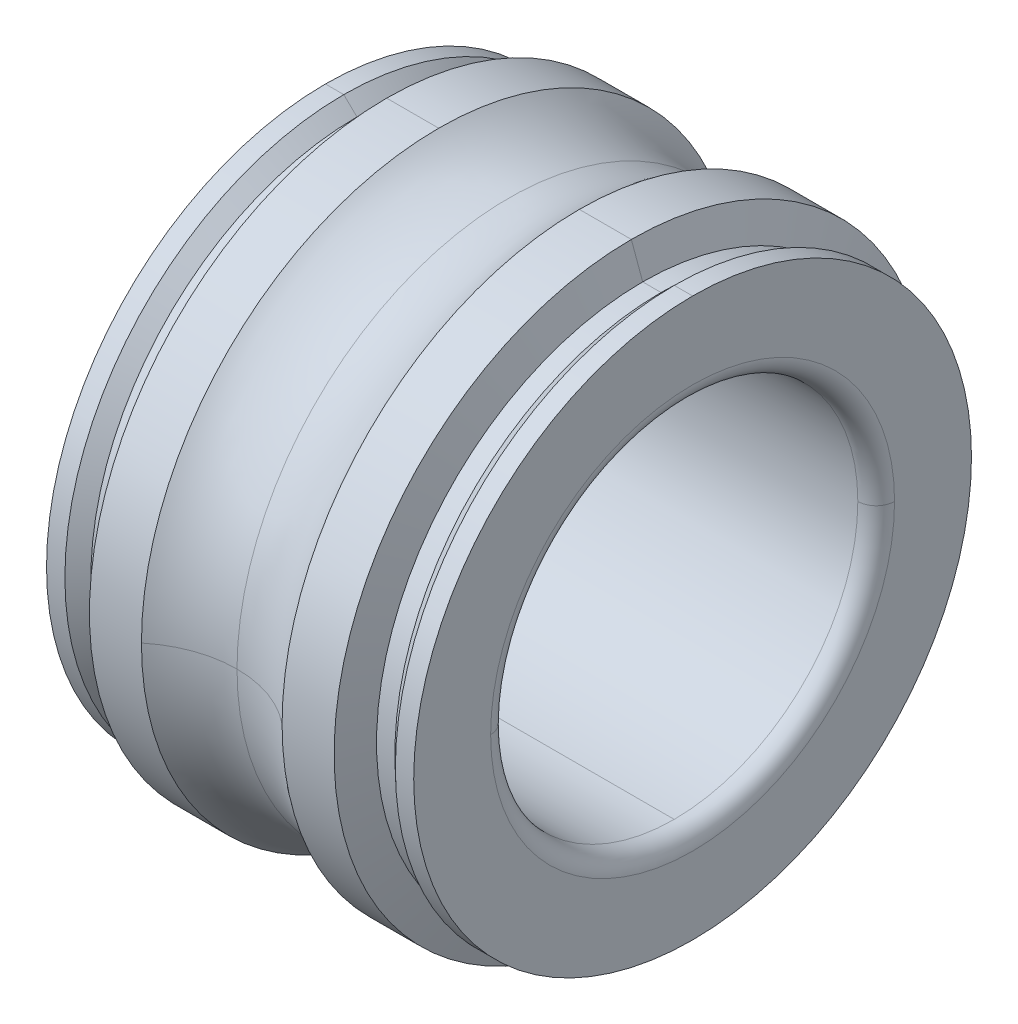
ISO-10303-21;
HEADER;
FILE_DESCRIPTION(('STEP AP214'),'2;1');
FILE_NAME('part.step','',(''),(''),'','','');
FILE_SCHEMA(('AUTOMOTIVE_DESIGN { 1 0 10303 214 1 1 1 1 }'));
ENDSEC;
DATA;
#1=APPLICATION_CONTEXT('core data for automotive mechanical design processes');
#2=APPLICATION_PROTOCOL_DEFINITION('international standard','automotive_design',2000,#1);
#3=PRODUCT_CONTEXT('',#1,'mechanical');
#4=PRODUCT('Part','Part','',(#3));
#5=PRODUCT_RELATED_PRODUCT_CATEGORY('part','',(#4));
#6=PRODUCT_DEFINITION_FORMATION('','',#4);
#7=PRODUCT_DEFINITION_CONTEXT('part definition',#1,'design');
#8=PRODUCT_DEFINITION('design','',#6,#7);
#9=PRODUCT_DEFINITION_SHAPE('','',#8);
#10=(LENGTH_UNIT() NAMED_UNIT(*) SI_UNIT(.MILLI.,.METRE.));
#11=(NAMED_UNIT(*) PLANE_ANGLE_UNIT() SI_UNIT($,.RADIAN.));
#12=(NAMED_UNIT(*) SI_UNIT($,.STERADIAN.) SOLID_ANGLE_UNIT());
#13=UNCERTAINTY_MEASURE_WITH_UNIT(LENGTH_MEASURE(1.E-05),#10,'distance_accuracy_value','');
#14=(GEOMETRIC_REPRESENTATION_CONTEXT(3) GLOBAL_UNCERTAINTY_ASSIGNED_CONTEXT((#13)) GLOBAL_UNIT_ASSIGNED_CONTEXT((#10,
#11,#12)) REPRESENTATION_CONTEXT('',''));
#15=CARTESIAN_POINT('',(0.,0.,0.));
#16=DIRECTION('',(0.,0.,1.));
#17=DIRECTION('',(1.,0.,0.));
#18=AXIS2_PLACEMENT_3D('',#15,#16,#17);
#19=CARTESIAN_POINT('',(3.,3.3,0.));
#20=DIRECTION('',(1.,0.,0.));
#21=DIRECTION('',(0.,1.,0.));
#22=AXIS2_PLACEMENT_3D('',#19,#20,#21);
#23=PLANE('',#22);
#24=CARTESIAN_POINT('',(3.,0.,0.));
#25=DIRECTION('',(1.,0.,0.));
#26=DIRECTION('',(0.,0.,-1.));
#27=AXIS2_PLACEMENT_3D('',#24,#25,#26);
#28=CIRCLE('',#27,3.3);
#29=CARTESIAN_POINT('',(3.,0.,-3.3));
#30=VERTEX_POINT('',#29);
#31=CARTESIAN_POINT('',(3.,0.,3.3));
#32=VERTEX_POINT('',#31);
#33=EDGE_CURVE('E304',#30,#32,#28,.T.);
#34=ORIENTED_EDGE('',*,*,#33,.F.);
#35=CARTESIAN_POINT('',(3.,0.,0.));
#36=DIRECTION('',(1.,0.,0.));
#37=DIRECTION('',(0.,0.,-1.));
#38=AXIS2_PLACEMENT_3D('',#35,#36,#37);
#39=CIRCLE('',#38,3.3);
#40=EDGE_CURVE('E11',#32,#30,#39,.T.);
#41=ORIENTED_EDGE('',*,*,#40,.F.);
#42=EDGE_LOOP('',(#34,#41));
#43=FACE_BOUND('',#42,.T.);
#44=CARTESIAN_POINT('',(3.,0.,0.));
#45=DIRECTION('',(1.,0.,0.));
#46=DIRECTION('',(0.,0.,-1.));
#47=AXIS2_PLACEMENT_3D('',#44,#45,#46);
#48=CIRCLE('',#47,4.55714285714286);
#49=CARTESIAN_POINT('',(3.,4.55714285714286,0.));
#50=VERTEX_POINT('',#49);
#51=CARTESIAN_POINT('',(3.,-4.55714285714286,0.));
#52=VERTEX_POINT('',#51);
#53=EDGE_CURVE('E340',#50,#52,#48,.T.);
#54=ORIENTED_EDGE('',*,*,#53,.T.);
#55=CARTESIAN_POINT('',(3.,0.,0.));
#56=DIRECTION('',(1.,0.,0.));
#57=DIRECTION('',(0.,0.,-1.));
#58=AXIS2_PLACEMENT_3D('',#55,#56,#57);
#59=CIRCLE('',#58,4.55714285714286);
#60=EDGE_CURVE('E41',#52,#50,#59,.T.);
#61=ORIENTED_EDGE('',*,*,#60,.T.);
#62=EDGE_LOOP('',(#54,#61));
#63=FACE_BOUND('',#62,.T.);
#64=ADVANCED_FACE('F16',(#43,#63),#23,.T.);
#65=CARTESIAN_POINT('',(2.7,0.,0.));
#66=DIRECTION('',(1.,0.,0.));
#67=DIRECTION('',(0.,0.,-1.));
#68=AXIS2_PLACEMENT_3D('',#65,#66,#67);
#69=TOROIDAL_SURFACE('',#68,3.3,0.3);
#70=CARTESIAN_POINT('',(2.7,0.,3.3));
#71=DIRECTION('',(0.,1.,0.));
#72=DIRECTION('',(0.,0.,1.));
#73=AXIS2_PLACEMENT_3D('',#70,#71,#72);
#74=CIRCLE('',#73,0.3);
#75=CARTESIAN_POINT('',(2.7,0.,3.));
#76=VERTEX_POINT('',#75);
#77=EDGE_CURVE('E308',#32,#76,#74,.T.);
#78=ORIENTED_EDGE('',*,*,#77,.F.);
#79=ORIENTED_EDGE('',*,*,#40,.T.);
#80=CARTESIAN_POINT('',(2.7,0.,-3.3));
#81=DIRECTION('',(0.,-1.,0.));
#82=DIRECTION('',(0.,0.,-1.));
#83=AXIS2_PLACEMENT_3D('',#80,#81,#82);
#84=CIRCLE('',#83,0.3);
#85=CARTESIAN_POINT('',(2.7,0.,-3.));
#86=VERTEX_POINT('',#85);
#87=EDGE_CURVE('E270',#30,#86,#84,.T.);
#88=ORIENTED_EDGE('',*,*,#87,.T.);
#89=CARTESIAN_POINT('',(2.7,0.,0.));
#90=DIRECTION('',(1.,0.,0.));
#91=DIRECTION('',(0.,0.,-1.));
#92=AXIS2_PLACEMENT_3D('',#89,#90,#91);
#93=CIRCLE('',#92,3.);
#94=CARTESIAN_POINT('',(2.7,-3.,0.));
#95=VERTEX_POINT('',#94);
#96=EDGE_CURVE('E280',#95,#86,#93,.T.);
#97=ORIENTED_EDGE('',*,*,#96,.F.);
#98=CARTESIAN_POINT('',(2.7,0.,0.));
#99=DIRECTION('',(1.,0.,0.));
#100=DIRECTION('',(0.,0.,-1.));
#101=AXIS2_PLACEMENT_3D('',#98,#99,#100);
#102=CIRCLE('',#101,3.);
#103=EDGE_CURVE('E27',#76,#95,#102,.T.);
#104=ORIENTED_EDGE('',*,*,#103,.F.);
#105=EDGE_LOOP('',(#78,#79,#88,#97,#104));
#106=FACE_BOUND('',#105,.T.);
#107=ADVANCED_FACE('F515',(#106),#69,.T.);
#108=CARTESIAN_POINT('',(0.,0.,0.));
#109=DIRECTION('',(1.,0.,0.));
#110=DIRECTION('',(0.,1.,0.));
#111=AXIS2_PLACEMENT_3D('',#108,#109,#110);
#112=CYLINDRICAL_SURFACE('',#111,3.);
#113=DIRECTION('',(1.,0.,0.));
#114=VECTOR('',#113,1.);
#115=CARTESIAN_POINT('',(0.,-3.,0.));
#116=LINE('',#115,#114);
#117=CARTESIAN_POINT('',(-2.7,-3.,0.));
#118=VERTEX_POINT('',#117);
#119=EDGE_CURVE('E269',#118,#95,#116,.T.);
#120=ORIENTED_EDGE('',*,*,#119,.F.);
#121=CARTESIAN_POINT('',(-2.7,0.,0.));
#122=DIRECTION('',(1.,0.,0.));
#123=DIRECTION('',(0.,0.,-1.));
#124=AXIS2_PLACEMENT_3D('',#121,#122,#123);
#125=CIRCLE('',#124,3.);
#126=CARTESIAN_POINT('',(-2.7,0.,3.));
#127=VERTEX_POINT('',#126);
#128=EDGE_CURVE('E332',#127,#118,#125,.T.);
#129=ORIENTED_EDGE('',*,*,#128,.F.);
#130=CARTESIAN_POINT('',(-2.7,0.,0.));
#131=DIRECTION('',(1.,0.,0.));
#132=DIRECTION('',(0.,0.,-1.));
#133=AXIS2_PLACEMENT_3D('',#130,#131,#132);
#134=CIRCLE('',#133,3.);
#135=CARTESIAN_POINT('',(-2.7,3.,0.));
#136=VERTEX_POINT('',#135);
#137=EDGE_CURVE('E352',#136,#127,#134,.T.);
#138=ORIENTED_EDGE('',*,*,#137,.F.);
#139=DIRECTION('',(1.,0.,0.));
#140=VECTOR('',#139,1.);
#141=CARTESIAN_POINT('',(0.,3.,0.));
#142=LINE('',#141,#140);
#143=CARTESIAN_POINT('',(2.7,3.,0.));
#144=VERTEX_POINT('',#143);
#145=EDGE_CURVE('E301',#136,#144,#142,.T.);
#146=ORIENTED_EDGE('',*,*,#145,.T.);
#147=CARTESIAN_POINT('',(2.7,0.,0.));
#148=DIRECTION('',(1.,0.,0.));
#149=DIRECTION('',(0.,0.,-1.));
#150=AXIS2_PLACEMENT_3D('',#147,#148,#149);
#151=CIRCLE('',#150,3.);
#152=EDGE_CURVE('E20',#144,#76,#151,.T.);
#153=ORIENTED_EDGE('',*,*,#152,.T.);
#154=ORIENTED_EDGE('',*,*,#103,.T.);
#155=EDGE_LOOP('',(#120,#129,#138,#146,#153,#154));
#156=FACE_BOUND('',#155,.T.);
#157=ADVANCED_FACE('F521',(#156),#112,.F.);
#158=CARTESIAN_POINT('',(-2.7,0.,0.));
#159=DIRECTION('',(1.,0.,0.));
#160=DIRECTION('',(0.,0.,-1.));
#161=AXIS2_PLACEMENT_3D('',#158,#159,#160);
#162=TOROIDAL_SURFACE('',#161,3.3,0.3);
#163=CARTESIAN_POINT('',(-2.7,0.,3.3));
#164=DIRECTION('',(0.,1.,0.));
#165=DIRECTION('',(0.,0.,1.));
#166=AXIS2_PLACEMENT_3D('',#163,#164,#165);
#167=CIRCLE('',#166,0.3);
#168=CARTESIAN_POINT('',(-3.,0.,3.3));
#169=VERTEX_POINT('',#168);
#170=EDGE_CURVE('E356',#127,#169,#167,.T.);
#171=ORIENTED_EDGE('',*,*,#170,.F.);
#172=ORIENTED_EDGE('',*,*,#128,.T.);
#173=CARTESIAN_POINT('',(-2.7,0.,0.));
#174=DIRECTION('',(1.,0.,0.));
#175=DIRECTION('',(0.,0.,-1.));
#176=AXIS2_PLACEMENT_3D('',#173,#174,#175);
#177=CIRCLE('',#176,3.);
#178=CARTESIAN_POINT('',(-2.7,0.,-3.));
#179=VERTEX_POINT('',#178);
#180=EDGE_CURVE('E266',#118,#179,#177,.T.);
#181=ORIENTED_EDGE('',*,*,#180,.T.);
#182=CARTESIAN_POINT('',(-2.7,0.,-3.3));
#183=DIRECTION('',(0.,-1.,0.));
#184=DIRECTION('',(0.,0.,-1.));
#185=AXIS2_PLACEMENT_3D('',#182,#183,#184);
#186=CIRCLE('',#185,0.3);
#187=CARTESIAN_POINT('',(-3.,0.,-3.3));
#188=VERTEX_POINT('',#187);
#189=EDGE_CURVE('E432',#179,#188,#186,.T.);
#190=ORIENTED_EDGE('',*,*,#189,.T.);
#191=CARTESIAN_POINT('',(-3.,0.,0.));
#192=DIRECTION('',(1.,0.,0.));
#193=DIRECTION('',(0.,0.,-1.));
#194=AXIS2_PLACEMENT_3D('',#191,#192,#193);
#195=CIRCLE('',#194,3.3);
#196=EDGE_CURVE('E335',#169,#188,#195,.T.);
#197=ORIENTED_EDGE('',*,*,#196,.F.);
#198=EDGE_LOOP('',(#171,#172,#181,#190,#197));
#199=FACE_BOUND('',#198,.T.);
#200=ADVANCED_FACE('F541',(#199),#162,.T.);
#201=CARTESIAN_POINT('',(-3.,4.55714285714286,0.));
#202=DIRECTION('',(-1.,0.,0.));
#203=DIRECTION('',(0.,0.,1.));
#204=AXIS2_PLACEMENT_3D('',#201,#202,#203);
#205=PLANE('',#204);
#206=CARTESIAN_POINT('',(-3.,0.,0.));
#207=DIRECTION('',(1.,0.,0.));
#208=DIRECTION('',(0.,0.,-1.));
#209=AXIS2_PLACEMENT_3D('',#206,#207,#208);
#210=CIRCLE('',#209,3.3);
#211=EDGE_CURVE('E365',#188,#169,#210,.T.);
#212=ORIENTED_EDGE('',*,*,#211,.T.);
#213=ORIENTED_EDGE('',*,*,#196,.T.);
#214=EDGE_LOOP('',(#212,#213));
#215=FACE_BOUND('',#214,.T.);
#216=CARTESIAN_POINT('',(-3.,0.,0.));
#217=DIRECTION('',(1.,0.,0.));
#218=DIRECTION('',(0.,0.,-1.));
#219=AXIS2_PLACEMENT_3D('',#216,#217,#218);
#220=CIRCLE('',#219,4.55714285714286);
#221=CARTESIAN_POINT('',(-3.,4.55714285714286,0.));
#222=VERTEX_POINT('',#221);
#223=CARTESIAN_POINT('',(-3.,-4.55714285714286,0.));
#224=VERTEX_POINT('',#223);
#225=EDGE_CURVE('E374',#222,#224,#220,.T.);
#226=ORIENTED_EDGE('',*,*,#225,.F.);
#227=CARTESIAN_POINT('',(-3.,0.,0.));
#228=DIRECTION('',(1.,0.,0.));
#229=DIRECTION('',(0.,0.,-1.));
#230=AXIS2_PLACEMENT_3D('',#227,#228,#229);
#231=CIRCLE('',#230,4.55714285714286);
#232=EDGE_CURVE('E402',#224,#222,#231,.T.);
#233=ORIENTED_EDGE('',*,*,#232,.F.);
#234=EDGE_LOOP('',(#226,#233));
#235=FACE_BOUND('',#234,.T.);
#236=ADVANCED_FACE('F538',(#215,#235),#205,.T.);
#237=CARTESIAN_POINT('',(-2.85,0.,0.));
#238=DIRECTION('',(1.,0.,0.));
#239=DIRECTION('',(0.,1.,0.));
#240=AXIS2_PLACEMENT_3D('',#237,#238,#239);
#241=CYLINDRICAL_SURFACE('',#240,4.55714285714286);
#242=DIRECTION('',(1.,0.,0.));
#243=VECTOR('',#242,1.);
#244=CARTESIAN_POINT('',(-2.85,-4.55714285714286,0.));
#245=LINE('',#244,#243);
#246=CARTESIAN_POINT('',(-2.7,-4.55714285714287,0.));
#247=VERTEX_POINT('',#246);
#248=EDGE_CURVE('E370',#224,#247,#245,.T.);
#249=ORIENTED_EDGE('',*,*,#248,.F.);
#250=ORIENTED_EDGE('',*,*,#232,.T.);
#251=DIRECTION('',(1.,0.,0.));
#252=VECTOR('',#251,1.);
#253=CARTESIAN_POINT('',(-2.85,4.55714285714286,0.));
#254=LINE('',#253,#252);
#255=CARTESIAN_POINT('',(-2.7,4.55714285714287,0.));
#256=VERTEX_POINT('',#255);
#257=EDGE_CURVE('E318',#222,#256,#254,.T.);
#258=ORIENTED_EDGE('',*,*,#257,.T.);
#259=CARTESIAN_POINT('',(-2.7,0.,0.));
#260=DIRECTION('',(1.,0.,0.));
#261=DIRECTION('',(0.,0.,-1.));
#262=AXIS2_PLACEMENT_3D('',#259,#260,#261);
#263=CIRCLE('',#262,4.55714285714286);
#264=EDGE_CURVE('E391',#247,#256,#263,.T.);
#265=ORIENTED_EDGE('',*,*,#264,.F.);
#266=EDGE_LOOP('',(#249,#250,#258,#265));
#267=FACE_BOUND('',#266,.T.);
#268=ADVANCED_FACE('F18',(#267),#241,.T.);
#269=CARTESIAN_POINT('',(-2.5920990299492,0.,0.));
#270=DIRECTION('',(-1.,0.,0.));
#271=DIRECTION('',(0.,1.,0.));
#272=AXIS2_PLACEMENT_3D('',#269,#270,#271);
#273=CONICAL_SURFACE('',#272,4.45294410157401,0.767944870877516);
#274=DIRECTION('',(-0.719339800338644,-0.694658370459005,0.));
#275=VECTOR('',#274,1.);
#276=CARTESIAN_POINT('',(-2.5920990299492,-4.45294410157401,0.));
#277=LINE('',#276,#275);
#278=CARTESIAN_POINT('',(-2.48419805989841,-4.34874534600516,0.));
#279=VERTEX_POINT('',#278);
#280=EDGE_CURVE('E317',#279,#247,#277,.T.);
#281=ORIENTED_EDGE('',*,*,#280,.F.);
#282=CARTESIAN_POINT('',(-2.48419805989841,0.,0.));
#283=DIRECTION('',(1.,0.,0.));
#284=DIRECTION('',(0.,0.,-1.));
#285=AXIS2_PLACEMENT_3D('',#282,#283,#284);
#286=CIRCLE('',#285,4.34874534600516);
#287=CARTESIAN_POINT('',(-2.48419805989841,4.34874534600516,0.));
#288=VERTEX_POINT('',#287);
#289=EDGE_CURVE('E321',#288,#279,#286,.T.);
#290=ORIENTED_EDGE('',*,*,#289,.F.);
#291=DIRECTION('',(-0.719339800338644,0.694658370459005,0.));
#292=VECTOR('',#291,1.);
#293=CARTESIAN_POINT('',(-2.5920990299492,4.45294410157401,0.));
#294=LINE('',#293,#292);
#295=EDGE_CURVE('E369',#288,#256,#294,.T.);
#296=ORIENTED_EDGE('',*,*,#295,.T.);
#297=CARTESIAN_POINT('',(-2.7,0.,0.));
#298=DIRECTION('',(1.,0.,0.));
#299=DIRECTION('',(0.,0.,-1.));
#300=AXIS2_PLACEMENT_3D('',#297,#298,#299);
#301=CIRCLE('',#300,4.55714285714286);
#302=EDGE_CURVE('E326',#256,#247,#301,.T.);
#303=ORIENTED_EDGE('',*,*,#302,.T.);
#304=EDGE_LOOP('',(#281,#290,#296,#303));
#305=FACE_BOUND('',#304,.T.);
#306=ADVANCED_FACE('F563',(#305),#273,.T.);
#307=CARTESIAN_POINT('',(-2.33419805989841,0.,0.));
#308=DIRECTION('',(1.,0.,0.));
#309=DIRECTION('',(0.,1.,0.));
#310=AXIS2_PLACEMENT_3D('',#307,#308,#309);
#311=CYLINDRICAL_SURFACE('',#310,4.34874534600516);
#312=DIRECTION('',(1.,0.,0.));
#313=VECTOR('',#312,1.);
#314=CARTESIAN_POINT('',(-2.33419805989841,-4.34874534600516,0.));
#315=LINE('',#314,#313);
#316=CARTESIAN_POINT('',(-2.18419805989841,-4.34874534600516,0.));
#317=VERTEX_POINT('',#316);
#318=EDGE_CURVE('E312',#279,#317,#315,.T.);
#319=ORIENTED_EDGE('',*,*,#318,.F.);
#320=CARTESIAN_POINT('',(-2.48419805989841,0.,0.));
#321=DIRECTION('',(1.,0.,0.));
#322=DIRECTION('',(0.,0.,-1.));
#323=AXIS2_PLACEMENT_3D('',#320,#321,#322);
#324=CIRCLE('',#323,4.34874534600516);
#325=EDGE_CURVE('E313',#279,#288,#324,.T.);
#326=ORIENTED_EDGE('',*,*,#325,.T.);
#327=DIRECTION('',(1.,0.,0.));
#328=VECTOR('',#327,1.);
#329=CARTESIAN_POINT('',(-2.33419805989841,4.34874534600516,0.));
#330=LINE('',#329,#328);
#331=CARTESIAN_POINT('',(-2.18419805989841,4.34874534600516,0.));
#332=VERTEX_POINT('',#331);
#333=EDGE_CURVE('E256',#288,#332,#330,.T.);
#334=ORIENTED_EDGE('',*,*,#333,.T.);
#335=CARTESIAN_POINT('',(-2.18419805989841,0.,0.));
#336=DIRECTION('',(1.,0.,0.));
#337=DIRECTION('',(0.,0.,-1.));
#338=AXIS2_PLACEMENT_3D('',#335,#336,#337);
#339=CIRCLE('',#338,4.34874534600516);
#340=EDGE_CURVE('E408',#317,#332,#339,.T.);
#341=ORIENTED_EDGE('',*,*,#340,.F.);
#342=EDGE_LOOP('',(#319,#326,#334,#341));
#343=FACE_BOUND('',#342,.T.);
#344=ADVANCED_FACE('F535',(#343),#311,.T.);
#345=CARTESIAN_POINT('',(-2.09167727928384,0.,0.));
#346=DIRECTION('',(1.,0.,0.));
#347=DIRECTION('',(0.,1.,0.));
#348=AXIS2_PLACEMENT_3D('',#345,#346,#347);
#349=CONICAL_SURFACE('',#348,4.60294410157401,1.22173047639603);
#350=DIRECTION('',(0.342020143325669,-0.939692620785908,0.));
#351=VECTOR('',#350,1.);
#352=CARTESIAN_POINT('',(-2.09167727928384,-4.60294410157401,0.));
#353=LINE('',#352,#351);
#354=CARTESIAN_POINT('',(-1.99915649866927,-4.85714285714286,0.));
#355=VERTEX_POINT('',#354);
#356=EDGE_CURVE('E260',#317,#355,#353,.T.);
#357=ORIENTED_EDGE('',*,*,#356,.F.);
#358=ORIENTED_EDGE('',*,*,#340,.T.);
#359=DIRECTION('',(0.342020143325669,0.939692620785908,0.));
#360=VECTOR('',#359,1.);
#361=CARTESIAN_POINT('',(-2.09167727928384,4.60294410157401,0.));
#362=LINE('',#361,#360);
#363=CARTESIAN_POINT('',(-1.99915649866927,4.85714285714286,0.));
#364=VERTEX_POINT('',#363);
#365=EDGE_CURVE('E255',#332,#364,#362,.T.);
#366=ORIENTED_EDGE('',*,*,#365,.T.);
#367=CARTESIAN_POINT('',(-1.99915649866927,0.,0.));
#368=DIRECTION('',(1.,0.,0.));
#369=DIRECTION('',(0.,0.,-1.));
#370=AXIS2_PLACEMENT_3D('',#367,#368,#369);
#371=CIRCLE('',#370,4.85714285714286);
#372=EDGE_CURVE('E438',#355,#364,#371,.T.);
#373=ORIENTED_EDGE('',*,*,#372,.F.);
#374=EDGE_LOOP('',(#357,#358,#366,#373));
#375=FACE_BOUND('',#374,.T.);
#376=ADVANCED_FACE('F489',(#375),#349,.T.);
#377=CARTESIAN_POINT('',(-1.57403012803932,0.,0.));
#378=DIRECTION('',(1.,0.,0.));
#379=DIRECTION('',(0.,1.,0.));
#380=AXIS2_PLACEMENT_3D('',#377,#378,#379);
#381=CYLINDRICAL_SURFACE('',#380,4.85714285714286);
#382=DIRECTION('',(1.,0.,0.));
#383=VECTOR('',#382,1.);
#384=CARTESIAN_POINT('',(-1.57403012803932,-4.85714285714286,0.));
#385=LINE('',#384,#383);
#386=CARTESIAN_POINT('',(-1.14890375740937,-4.85714285714286,0.));
#387=VERTEX_POINT('',#386);
#388=EDGE_CURVE('E250',#355,#387,#385,.T.);
#389=ORIENTED_EDGE('',*,*,#388,.F.);
#390=ORIENTED_EDGE('',*,*,#372,.T.);
#391=DIRECTION('',(1.,0.,0.));
#392=VECTOR('',#391,1.);
#393=CARTESIAN_POINT('',(-1.57403012803932,4.85714285714286,0.));
#394=LINE('',#393,#392);
#395=CARTESIAN_POINT('',(-1.14890375740937,4.85714285714286,0.));
#396=VERTEX_POINT('',#395);
#397=EDGE_CURVE('E241',#364,#396,#394,.T.);
#398=ORIENTED_EDGE('',*,*,#397,.T.);
#399=CARTESIAN_POINT('',(-1.14890375740937,0.,0.));
#400=DIRECTION('',(1.,0.,0.));
#401=DIRECTION('',(0.,0.,-1.));
#402=AXIS2_PLACEMENT_3D('',#399,#400,#401);
#403=CIRCLE('',#402,4.85714285714286);
#404=CARTESIAN_POINT('',(-1.14890375740937,0.,-4.85714285714286));
#405=VERTEX_POINT('',#404);
#406=EDGE_CURVE('E240',#405,#396,#403,.T.);
#407=ORIENTED_EDGE('',*,*,#406,.F.);
#408=CARTESIAN_POINT('',(-1.14890375740937,0.,0.));
#409=DIRECTION('',(1.,0.,0.));
#410=DIRECTION('',(0.,0.,-1.));
#411=AXIS2_PLACEMENT_3D('',#408,#409,#410);
#412=CIRCLE('',#411,4.85714285714286);
#413=EDGE_CURVE('E452',#387,#405,#412,.T.);
#414=ORIENTED_EDGE('',*,*,#413,.F.);
#415=EDGE_LOOP('',(#389,#390,#398,#407,#414));
#416=FACE_BOUND('',#415,.T.);
#417=ADVANCED_FACE('F499',(#416),#381,.T.);
#418=CARTESIAN_POINT('',(0.,0.,0.));
#419=DIRECTION('',(1.,0.,0.));
#420=DIRECTION('',(0.,0.,-1.));
#421=AXIS2_PLACEMENT_3D('',#418,#419,#420);
#422=TOROIDAL_SURFACE('',#421,6.25,1.80555555555555);
#423=CARTESIAN_POINT('',(0.,0.,0.));
#424=DIRECTION('',(1.,0.,0.));
#425=DIRECTION('',(0.,0.,-1.));
#426=AXIS2_PLACEMENT_3D('',#423,#424,#425);
#427=CIRCLE('',#426,4.44444444444445);
#428=CARTESIAN_POINT('',(0.,0.,-4.44444444444445));
#429=VERTEX_POINT('',#428);
#430=CARTESIAN_POINT('',(0.,0.,4.44444444444445));
#431=VERTEX_POINT('',#430);
#432=EDGE_CURVE('E265',#429,#431,#427,.T.);
#433=ORIENTED_EDGE('',*,*,#432,.F.);
#434=CARTESIAN_POINT('',(0.,0.,-6.25));
#435=DIRECTION('',(0.,-1.,0.));
#436=DIRECTION('',(0.,0.,-1.));
#437=AXIS2_PLACEMENT_3D('',#434,#435,#436);
#438=CIRCLE('',#437,1.80555555555555);
#439=EDGE_CURVE('E235',#429,#405,#438,.T.);
#440=ORIENTED_EDGE('',*,*,#439,.T.);
#441=ORIENTED_EDGE('',*,*,#406,.T.);
#442=CARTESIAN_POINT('',(-1.14890375740937,0.,0.));
#443=DIRECTION('',(1.,0.,0.));
#444=DIRECTION('',(0.,0.,-1.));
#445=AXIS2_PLACEMENT_3D('',#442,#443,#444);
#446=CIRCLE('',#445,4.85714285714286);
#447=CARTESIAN_POINT('',(-1.14890375740937,0.,4.85714285714286));
#448=VERTEX_POINT('',#447);
#449=EDGE_CURVE('E246',#396,#448,#446,.T.);
#450=ORIENTED_EDGE('',*,*,#449,.T.);
#451=CARTESIAN_POINT('',(0.,0.,6.25));
#452=DIRECTION('',(0.,1.,0.));
#453=DIRECTION('',(0.,0.,1.));
#454=AXIS2_PLACEMENT_3D('',#451,#452,#453);
#455=CIRCLE('',#454,1.80555555555555);
#456=EDGE_CURVE('E245',#431,#448,#455,.T.);
#457=ORIENTED_EDGE('',*,*,#456,.F.);
#458=EDGE_LOOP('',(#433,#440,#441,#450,#457));
#459=FACE_BOUND('',#458,.T.);
#460=ADVANCED_FACE('F530',(#459),#422,.F.);
#461=CARTESIAN_POINT('',(1.57403012803932,0.,0.));
#462=DIRECTION('',(1.,0.,0.));
#463=DIRECTION('',(0.,1.,0.));
#464=AXIS2_PLACEMENT_3D('',#461,#462,#463);
#465=CYLINDRICAL_SURFACE('',#464,4.85714285714286);
#466=DIRECTION('',(1.,0.,0.));
#467=VECTOR('',#466,1.);
#468=CARTESIAN_POINT('',(1.57403012803932,-4.85714285714286,0.));
#469=LINE('',#468,#467);
#470=CARTESIAN_POINT('',(1.14890375740937,-4.85714285714286,0.));
#471=VERTEX_POINT('',#470);
#472=CARTESIAN_POINT('',(1.99915649866926,-4.85714285714288,0.));
#473=VERTEX_POINT('',#472);
#474=EDGE_CURVE('E249',#471,#473,#469,.T.);
#475=ORIENTED_EDGE('',*,*,#474,.F.);
#476=CARTESIAN_POINT('',(1.14890375740937,0.,0.));
#477=DIRECTION('',(1.,0.,0.));
#478=DIRECTION('',(0.,0.,-1.));
#479=AXIS2_PLACEMENT_3D('',#476,#477,#478);
#480=CIRCLE('',#479,4.85714285714286);
#481=CARTESIAN_POINT('',(1.14890375740937,0.,-4.85714285714286));
#482=VERTEX_POINT('',#481);
#483=EDGE_CURVE('E345',#471,#482,#480,.T.);
#484=ORIENTED_EDGE('',*,*,#483,.T.);
#485=CARTESIAN_POINT('',(1.14890375740937,0.,0.));
#486=DIRECTION('',(1.,0.,0.));
#487=DIRECTION('',(0.,0.,-1.));
#488=AXIS2_PLACEMENT_3D('',#485,#486,#487);
#489=CIRCLE('',#488,4.85714285714286);
#490=CARTESIAN_POINT('',(1.14890375740937,4.85714285714286,0.));
#491=VERTEX_POINT('',#490);
#492=EDGE_CURVE('E346',#482,#491,#489,.T.);
#493=ORIENTED_EDGE('',*,*,#492,.T.);
#494=DIRECTION('',(1.,0.,0.));
#495=VECTOR('',#494,1.);
#496=CARTESIAN_POINT('',(1.57403012803932,4.85714285714286,0.));
#497=LINE('',#496,#495);
#498=CARTESIAN_POINT('',(1.99915649866926,4.85714285714288,0.));
#499=VERTEX_POINT('',#498);
#500=EDGE_CURVE('E226',#491,#499,#497,.T.);
#501=ORIENTED_EDGE('',*,*,#500,.T.);
#502=CARTESIAN_POINT('',(1.99915649866926,0.,0.));
#503=DIRECTION('',(1.,0.,0.));
#504=DIRECTION('',(0.,0.,-1.));
#505=AXIS2_PLACEMENT_3D('',#502,#503,#504);
#506=CIRCLE('',#505,4.85714285714286);
#507=EDGE_CURVE('E222',#473,#499,#506,.T.);
#508=ORIENTED_EDGE('',*,*,#507,.F.);
#509=EDGE_LOOP('',(#475,#484,#493,#501,#508));
#510=FACE_BOUND('',#509,.T.);
#511=ADVANCED_FACE('F528',(#510),#465,.T.);
#512=CARTESIAN_POINT('',(2.09167727928384,0.,0.));
#513=DIRECTION('',(-1.,0.,0.));
#514=DIRECTION('',(0.,1.,0.));
#515=AXIS2_PLACEMENT_3D('',#512,#513,#514);
#516=CONICAL_SURFACE('',#515,4.60294410157401,1.22173047639603);
#517=DIRECTION('',(-0.342020143325669,-0.939692620785908,0.));
#518=VECTOR('',#517,1.);
#519=CARTESIAN_POINT('',(2.09167727928384,-4.60294410157401,0.));
#520=LINE('',#519,#518);
#521=CARTESIAN_POINT('',(2.18419805989841,-4.34874534600516,0.));
#522=VERTEX_POINT('',#521);
#523=EDGE_CURVE('E214',#522,#473,#520,.T.);
#524=ORIENTED_EDGE('',*,*,#523,.F.);
#525=CARTESIAN_POINT('',(2.18419805989841,0.,0.));
#526=DIRECTION('',(1.,0.,0.));
#527=DIRECTION('',(0.,0.,-1.));
#528=AXIS2_PLACEMENT_3D('',#525,#526,#527);
#529=CIRCLE('',#528,4.34874534600516);
#530=CARTESIAN_POINT('',(2.18419805989841,4.34874534600516,0.));
#531=VERTEX_POINT('',#530);
#532=EDGE_CURVE('E201',#531,#522,#529,.T.);
#533=ORIENTED_EDGE('',*,*,#532,.F.);
#534=DIRECTION('',(-0.342020143325669,0.939692620785908,0.));
#535=VECTOR('',#534,1.);
#536=CARTESIAN_POINT('',(2.09167727928384,4.60294410157401,0.));
#537=LINE('',#536,#535);
#538=EDGE_CURVE('E210',#531,#499,#537,.T.);
#539=ORIENTED_EDGE('',*,*,#538,.T.);
#540=CARTESIAN_POINT('',(1.99915649866926,0.,0.));
#541=DIRECTION('',(1.,0.,0.));
#542=DIRECTION('',(0.,0.,-1.));
#543=AXIS2_PLACEMENT_3D('',#540,#541,#542);
#544=CIRCLE('',#543,4.85714285714286);
#545=EDGE_CURVE('E217',#499,#473,#544,.T.);
#546=ORIENTED_EDGE('',*,*,#545,.T.);
#547=EDGE_LOOP('',(#524,#533,#539,#546));
#548=FACE_BOUND('',#547,.T.);
#549=ADVANCED_FACE('F215',(#548),#516,.T.);
#550=CARTESIAN_POINT('',(2.33419805989841,0.,0.));
#551=DIRECTION('',(1.,0.,0.));
#552=DIRECTION('',(0.,1.,0.));
#553=AXIS2_PLACEMENT_3D('',#550,#551,#552);
#554=CYLINDRICAL_SURFACE('',#553,4.34874534600516);
#555=DIRECTION('',(1.,0.,0.));
#556=VECTOR('',#555,1.);
#557=CARTESIAN_POINT('',(2.33419805989841,-4.34874534600516,0.));
#558=LINE('',#557,#556);
#559=CARTESIAN_POINT('',(2.48419805989841,-4.34874534600516,0.));
#560=VERTEX_POINT('',#559);
#561=EDGE_CURVE('E189',#522,#560,#558,.T.);
#562=ORIENTED_EDGE('',*,*,#561,.F.);
#563=CARTESIAN_POINT('',(2.18419805989841,0.,0.));
#564=DIRECTION('',(1.,0.,0.));
#565=DIRECTION('',(0.,0.,-1.));
#566=AXIS2_PLACEMENT_3D('',#563,#564,#565);
#567=CIRCLE('',#566,4.34874534600516);
#568=EDGE_CURVE('E194',#522,#531,#567,.T.);
#569=ORIENTED_EDGE('',*,*,#568,.T.);
#570=DIRECTION('',(1.,0.,0.));
#571=VECTOR('',#570,1.);
#572=CARTESIAN_POINT('',(2.33419805989841,4.34874534600516,0.));
#573=LINE('',#572,#571);
#574=CARTESIAN_POINT('',(2.48419805989841,4.34874534600516,0.));
#575=VERTEX_POINT('',#574);
#576=EDGE_CURVE('E206',#531,#575,#573,.T.);
#577=ORIENTED_EDGE('',*,*,#576,.T.);
#578=CARTESIAN_POINT('',(2.48419805989841,0.,0.));
#579=DIRECTION('',(1.,0.,0.));
#580=DIRECTION('',(0.,0.,-1.));
#581=AXIS2_PLACEMENT_3D('',#578,#579,#580);
#582=CIRCLE('',#581,4.34874534600516);
#583=EDGE_CURVE('E195',#560,#575,#582,.T.);
#584=ORIENTED_EDGE('',*,*,#583,.F.);
#585=EDGE_LOOP('',(#562,#569,#577,#584));
#586=FACE_BOUND('',#585,.T.);
#587=ADVANCED_FACE('F191',(#586),#554,.T.);
#588=CARTESIAN_POINT('',(2.5920990299492,0.,0.));
#589=DIRECTION('',(1.,0.,0.));
#590=DIRECTION('',(0.,1.,0.));
#591=AXIS2_PLACEMENT_3D('',#588,#589,#590);
#592=CONICAL_SURFACE('',#591,4.45294410157401,0.767944870877516);
#593=DIRECTION('',(0.719339800338644,-0.694658370459005,0.));
#594=VECTOR('',#593,1.);
#595=CARTESIAN_POINT('',(2.5920990299492,-4.45294410157401,0.));
#596=LINE('',#595,#594);
#597=CARTESIAN_POINT('',(2.7,-4.55714285714286,0.));
#598=VERTEX_POINT('',#597);
#599=EDGE_CURVE('E331',#560,#598,#596,.T.);
#600=ORIENTED_EDGE('',*,*,#599,.F.);
#601=ORIENTED_EDGE('',*,*,#583,.T.);
#602=DIRECTION('',(0.719339800338644,0.694658370459005,0.));
#603=VECTOR('',#602,1.);
#604=CARTESIAN_POINT('',(2.5920990299492,4.45294410157401,0.));
#605=LINE('',#604,#603);
#606=CARTESIAN_POINT('',(2.7,4.55714285714286,0.));
#607=VERTEX_POINT('',#606);
#608=EDGE_CURVE('E399',#575,#607,#605,.T.);
#609=ORIENTED_EDGE('',*,*,#608,.T.);
#610=CARTESIAN_POINT('',(2.7,0.,0.));
#611=DIRECTION('',(1.,0.,0.));
#612=DIRECTION('',(0.,0.,-1.));
#613=AXIS2_PLACEMENT_3D('',#610,#611,#612);
#614=CIRCLE('',#613,4.55714285714286);
#615=EDGE_CURVE('E339',#598,#607,#614,.T.);
#616=ORIENTED_EDGE('',*,*,#615,.F.);
#617=EDGE_LOOP('',(#600,#601,#609,#616));
#618=FACE_BOUND('',#617,.T.);
#619=ADVANCED_FACE('F556',(#618),#592,.T.);
#620=CARTESIAN_POINT('',(2.85,0.,0.));
#621=DIRECTION('',(1.,0.,0.));
#622=DIRECTION('',(0.,1.,0.));
#623=AXIS2_PLACEMENT_3D('',#620,#621,#622);
#624=CYLINDRICAL_SURFACE('',#623,4.55714285714286);
#625=DIRECTION('',(1.,0.,0.));
#626=VECTOR('',#625,1.);
#627=CARTESIAN_POINT('',(2.85,-4.55714285714286,0.));
#628=LINE('',#627,#626);
#629=EDGE_CURVE('E395',#598,#52,#628,.T.);
#630=ORIENTED_EDGE('',*,*,#629,.F.);
#631=ORIENTED_EDGE('',*,*,#615,.T.);
#632=DIRECTION('',(1.,0.,0.));
#633=VECTOR('',#632,1.);
#634=CARTESIAN_POINT('',(2.85,4.55714285714286,0.));
#635=LINE('',#634,#633);
#636=EDGE_CURVE('E336',#607,#50,#635,.T.);
#637=ORIENTED_EDGE('',*,*,#636,.T.);
#638=ORIENTED_EDGE('',*,*,#60,.F.);
#639=EDGE_LOOP('',(#630,#631,#637,#638));
#640=FACE_BOUND('',#639,.T.);
#641=ADVANCED_FACE('F526',(#640),#624,.T.);
#642=CARTESIAN_POINT('',(2.85,0.,0.));
#643=DIRECTION('',(1.,0.,0.));
#644=DIRECTION('',(0.,1.,0.));
#645=AXIS2_PLACEMENT_3D('',#642,#643,#644);
#646=CYLINDRICAL_SURFACE('',#645,4.55714285714286);
#647=CARTESIAN_POINT('',(2.7,0.,0.));
#648=DIRECTION('',(1.,0.,0.));
#649=DIRECTION('',(0.,0.,-1.));
#650=AXIS2_PLACEMENT_3D('',#647,#648,#649);
#651=CIRCLE('',#650,4.55714285714286);
#652=EDGE_CURVE('E387',#607,#598,#651,.T.);
#653=ORIENTED_EDGE('',*,*,#652,.T.);
#654=ORIENTED_EDGE('',*,*,#629,.T.);
#655=ORIENTED_EDGE('',*,*,#53,.F.);
#656=ORIENTED_EDGE('',*,*,#636,.F.);
#657=EDGE_LOOP('',(#653,#654,#655,#656));
#658=FACE_BOUND('',#657,.T.);
#659=ADVANCED_FACE('F817',(#658),#646,.T.);
#660=CARTESIAN_POINT('',(2.5920990299492,0.,0.));
#661=DIRECTION('',(1.,0.,0.));
#662=DIRECTION('',(0.,1.,0.));
#663=AXIS2_PLACEMENT_3D('',#660,#661,#662);
#664=CONICAL_SURFACE('',#663,4.45294410157401,0.767944870877516);
#665=CARTESIAN_POINT('',(2.48419805989841,0.,0.));
#666=DIRECTION('',(1.,0.,0.));
#667=DIRECTION('',(0.,0.,-1.));
#668=AXIS2_PLACEMENT_3D('',#665,#666,#667);
#669=CIRCLE('',#668,4.34874534600516);
#670=EDGE_CURVE('E200',#575,#560,#669,.T.);
#671=ORIENTED_EDGE('',*,*,#670,.T.);
#672=ORIENTED_EDGE('',*,*,#599,.T.);
#673=ORIENTED_EDGE('',*,*,#652,.F.);
#674=ORIENTED_EDGE('',*,*,#608,.F.);
#675=EDGE_LOOP('',(#671,#672,#673,#674));
#676=FACE_BOUND('',#675,.T.);
#677=ADVANCED_FACE('F781',(#676),#664,.T.);
#678=CARTESIAN_POINT('',(2.33419805989841,0.,0.));
#679=DIRECTION('',(1.,0.,0.));
#680=DIRECTION('',(0.,1.,0.));
#681=AXIS2_PLACEMENT_3D('',#678,#679,#680);
#682=CYLINDRICAL_SURFACE('',#681,4.34874534600516);
#683=ORIENTED_EDGE('',*,*,#532,.T.);
#684=ORIENTED_EDGE('',*,*,#561,.T.);
#685=ORIENTED_EDGE('',*,*,#670,.F.);
#686=ORIENTED_EDGE('',*,*,#576,.F.);
#687=EDGE_LOOP('',(#683,#684,#685,#686));
#688=FACE_BOUND('',#687,.T.);
#689=ADVANCED_FACE('F205',(#688),#682,.T.);
#690=CARTESIAN_POINT('',(2.09167727928384,0.,0.));
#691=DIRECTION('',(-1.,0.,0.));
#692=DIRECTION('',(0.,1.,0.));
#693=AXIS2_PLACEMENT_3D('',#690,#691,#692);
#694=CONICAL_SURFACE('',#693,4.60294410157401,1.22173047639603);
#695=ORIENTED_EDGE('',*,*,#568,.F.);
#696=ORIENTED_EDGE('',*,*,#523,.T.);
#697=ORIENTED_EDGE('',*,*,#507,.T.);
#698=ORIENTED_EDGE('',*,*,#538,.F.);
#699=EDGE_LOOP('',(#695,#696,#697,#698));
#700=FACE_BOUND('',#699,.T.);
#701=ADVANCED_FACE('F224',(#700),#694,.T.);
#702=CARTESIAN_POINT('',(1.57403012803932,0.,0.));
#703=DIRECTION('',(1.,0.,0.));
#704=DIRECTION('',(0.,1.,0.));
#705=AXIS2_PLACEMENT_3D('',#702,#703,#704);
#706=CYLINDRICAL_SURFACE('',#705,4.85714285714286);
#707=CARTESIAN_POINT('',(1.14890375740937,0.,0.));
#708=DIRECTION('',(1.,0.,0.));
#709=DIRECTION('',(0.,0.,-1.));
#710=AXIS2_PLACEMENT_3D('',#707,#708,#709);
#711=CIRCLE('',#710,4.85714285714286);
#712=CARTESIAN_POINT('',(1.14890375740937,0.,4.85714285714286));
#713=VERTEX_POINT('',#712);
#714=EDGE_CURVE('E351',#491,#713,#711,.T.);
#715=ORIENTED_EDGE('',*,*,#714,.T.);
#716=CARTESIAN_POINT('',(1.14890375740937,0.,0.));
#717=DIRECTION('',(1.,0.,0.));
#718=DIRECTION('',(0.,0.,-1.));
#719=AXIS2_PLACEMENT_3D('',#716,#717,#718);
#720=CIRCLE('',#719,4.85714285714286);
#721=EDGE_CURVE('E299',#713,#471,#720,.T.);
#722=ORIENTED_EDGE('',*,*,#721,.T.);
#723=ORIENTED_EDGE('',*,*,#474,.T.);
#724=ORIENTED_EDGE('',*,*,#545,.F.);
#725=ORIENTED_EDGE('',*,*,#500,.F.);
#726=EDGE_LOOP('',(#715,#722,#723,#724,#725));
#727=FACE_BOUND('',#726,.T.);
#728=ADVANCED_FACE('F502',(#727),#706,.T.);
#729=CARTESIAN_POINT('',(0.,0.,0.));
#730=DIRECTION('',(1.,0.,0.));
#731=DIRECTION('',(0.,0.,-1.));
#732=AXIS2_PLACEMENT_3D('',#729,#730,#731);
#733=TOROIDAL_SURFACE('',#732,6.25,1.80555555555555);
#734=CARTESIAN_POINT('',(0.,0.,0.));
#735=DIRECTION('',(1.,0.,0.));
#736=DIRECTION('',(0.,0.,-1.));
#737=AXIS2_PLACEMENT_3D('',#734,#735,#736);
#738=CIRCLE('',#737,4.44444444444445);
#739=EDGE_CURVE('E341',#431,#429,#738,.T.);
#740=ORIENTED_EDGE('',*,*,#739,.F.);
#741=ORIENTED_EDGE('',*,*,#456,.T.);
#742=CARTESIAN_POINT('',(-1.14890375740937,0.,0.));
#743=DIRECTION('',(1.,0.,0.));
#744=DIRECTION('',(0.,0.,-1.));
#745=AXIS2_PLACEMENT_3D('',#742,#743,#744);
#746=CIRCLE('',#745,4.85714285714286);
#747=EDGE_CURVE('E254',#448,#387,#746,.T.);
#748=ORIENTED_EDGE('',*,*,#747,.T.);
#749=ORIENTED_EDGE('',*,*,#413,.T.);
#750=ORIENTED_EDGE('',*,*,#439,.F.);
#751=EDGE_LOOP('',(#740,#741,#748,#749,#750));
#752=FACE_BOUND('',#751,.T.);
#753=ADVANCED_FACE('F500',(#752),#733,.F.);
#754=CARTESIAN_POINT('',(-1.57403012803932,0.,0.));
#755=DIRECTION('',(1.,0.,0.));
#756=DIRECTION('',(0.,1.,0.));
#757=AXIS2_PLACEMENT_3D('',#754,#755,#756);
#758=CYLINDRICAL_SURFACE('',#757,4.85714285714286);
#759=CARTESIAN_POINT('',(-1.99915649866927,0.,0.));
#760=DIRECTION('',(1.,0.,0.));
#761=DIRECTION('',(0.,0.,-1.));
#762=AXIS2_PLACEMENT_3D('',#759,#760,#761);
#763=CIRCLE('',#762,4.85714285714286);
#764=EDGE_CURVE('E378',#364,#355,#763,.T.);
#765=ORIENTED_EDGE('',*,*,#764,.T.);
#766=ORIENTED_EDGE('',*,*,#388,.T.);
#767=ORIENTED_EDGE('',*,*,#747,.F.);
#768=ORIENTED_EDGE('',*,*,#449,.F.);
#769=ORIENTED_EDGE('',*,*,#397,.F.);
#770=EDGE_LOOP('',(#765,#766,#767,#768,#769));
#771=FACE_BOUND('',#770,.T.);
#772=ADVANCED_FACE('F495',(#771),#758,.T.);
#773=CARTESIAN_POINT('',(-2.09167727928384,0.,0.));
#774=DIRECTION('',(1.,0.,0.));
#775=DIRECTION('',(0.,1.,0.));
#776=AXIS2_PLACEMENT_3D('',#773,#774,#775);
#777=CONICAL_SURFACE('',#776,4.60294410157401,1.22173047639603);
#778=CARTESIAN_POINT('',(-2.18419805989841,0.,0.));
#779=DIRECTION('',(1.,0.,0.));
#780=DIRECTION('',(0.,0.,-1.));
#781=AXIS2_PLACEMENT_3D('',#778,#779,#780);
#782=CIRCLE('',#781,4.34874534600516);
#783=EDGE_CURVE('E261',#332,#317,#782,.T.);
#784=ORIENTED_EDGE('',*,*,#783,.T.);
#785=ORIENTED_EDGE('',*,*,#356,.T.);
#786=ORIENTED_EDGE('',*,*,#764,.F.);
#787=ORIENTED_EDGE('',*,*,#365,.F.);
#788=EDGE_LOOP('',(#784,#785,#786,#787));
#789=FACE_BOUND('',#788,.T.);
#790=ADVANCED_FACE('F492',(#789),#777,.T.);
#791=CARTESIAN_POINT('',(-2.33419805989841,0.,0.));
#792=DIRECTION('',(1.,0.,0.));
#793=DIRECTION('',(0.,1.,0.));
#794=AXIS2_PLACEMENT_3D('',#791,#792,#793);
#795=CYLINDRICAL_SURFACE('',#794,4.34874534600516);
#796=ORIENTED_EDGE('',*,*,#289,.T.);
#797=ORIENTED_EDGE('',*,*,#318,.T.);
#798=ORIENTED_EDGE('',*,*,#783,.F.);
#799=ORIENTED_EDGE('',*,*,#333,.F.);
#800=EDGE_LOOP('',(#796,#797,#798,#799));
#801=FACE_BOUND('',#800,.T.);
#802=ADVANCED_FACE('F803',(#801),#795,.T.);
#803=CARTESIAN_POINT('',(-2.5920990299492,0.,0.));
#804=DIRECTION('',(-1.,0.,0.));
#805=DIRECTION('',(0.,1.,0.));
#806=AXIS2_PLACEMENT_3D('',#803,#804,#805);
#807=CONICAL_SURFACE('',#806,4.45294410157401,0.767944870877516);
#808=ORIENTED_EDGE('',*,*,#325,.F.);
#809=ORIENTED_EDGE('',*,*,#280,.T.);
#810=ORIENTED_EDGE('',*,*,#264,.T.);
#811=ORIENTED_EDGE('',*,*,#295,.F.);
#812=EDGE_LOOP('',(#808,#809,#810,#811));
#813=FACE_BOUND('',#812,.T.);
#814=ADVANCED_FACE('F552',(#813),#807,.T.);
#815=CARTESIAN_POINT('',(-2.85,0.,0.));
#816=DIRECTION('',(1.,0.,0.));
#817=DIRECTION('',(0.,1.,0.));
#818=AXIS2_PLACEMENT_3D('',#815,#816,#817);
#819=CYLINDRICAL_SURFACE('',#818,4.55714285714286);
#820=ORIENTED_EDGE('',*,*,#225,.T.);
#821=ORIENTED_EDGE('',*,*,#248,.T.);
#822=ORIENTED_EDGE('',*,*,#302,.F.);
#823=ORIENTED_EDGE('',*,*,#257,.F.);
#824=EDGE_LOOP('',(#820,#821,#822,#823));
#825=FACE_BOUND('',#824,.T.);
#826=ADVANCED_FACE('F549',(#825),#819,.T.);
#827=CARTESIAN_POINT('',(-2.7,0.,0.));
#828=DIRECTION('',(1.,0.,0.));
#829=DIRECTION('',(0.,0.,-1.));
#830=AXIS2_PLACEMENT_3D('',#827,#828,#829);
#831=TOROIDAL_SURFACE('',#830,3.3,0.3);
#832=CARTESIAN_POINT('',(-2.7,0.,0.));
#833=DIRECTION('',(1.,0.,0.));
#834=DIRECTION('',(0.,0.,-1.));
#835=AXIS2_PLACEMENT_3D('',#832,#833,#834);
#836=CIRCLE('',#835,3.);
#837=EDGE_CURVE('E303',#179,#136,#836,.T.);
#838=ORIENTED_EDGE('',*,*,#837,.T.);
#839=ORIENTED_EDGE('',*,*,#137,.T.);
#840=ORIENTED_EDGE('',*,*,#170,.T.);
#841=ORIENTED_EDGE('',*,*,#211,.F.);
#842=ORIENTED_EDGE('',*,*,#189,.F.);
#843=EDGE_LOOP('',(#838,#839,#840,#841,#842));
#844=FACE_BOUND('',#843,.T.);
#845=ADVANCED_FACE('F547',(#844),#831,.T.);
#846=CARTESIAN_POINT('',(0.,0.,0.));
#847=DIRECTION('',(1.,0.,0.));
#848=DIRECTION('',(0.,1.,0.));
#849=AXIS2_PLACEMENT_3D('',#846,#847,#848);
#850=CYLINDRICAL_SURFACE('',#849,3.);
#851=ORIENTED_EDGE('',*,*,#180,.F.);
#852=ORIENTED_EDGE('',*,*,#119,.T.);
#853=ORIENTED_EDGE('',*,*,#96,.T.);
#854=CARTESIAN_POINT('',(2.7,0.,0.));
#855=DIRECTION('',(1.,0.,0.));
#856=DIRECTION('',(0.,0.,-1.));
#857=AXIS2_PLACEMENT_3D('',#854,#855,#856);
#858=CIRCLE('',#857,3.);
#859=EDGE_CURVE('E284',#86,#144,#858,.T.);
#860=ORIENTED_EDGE('',*,*,#859,.T.);
#861=ORIENTED_EDGE('',*,*,#145,.F.);
#862=ORIENTED_EDGE('',*,*,#837,.F.);
#863=EDGE_LOOP('',(#851,#852,#853,#860,#861,#862));
#864=FACE_BOUND('',#863,.T.);
#865=ADVANCED_FACE('F543',(#864),#850,.F.);
#866=CARTESIAN_POINT('',(2.7,0.,0.));
#867=DIRECTION('',(1.,0.,0.));
#868=DIRECTION('',(0.,0.,-1.));
#869=AXIS2_PLACEMENT_3D('',#866,#867,#868);
#870=TOROIDAL_SURFACE('',#869,3.3,0.3);
#871=ORIENTED_EDGE('',*,*,#33,.T.);
#872=ORIENTED_EDGE('',*,*,#77,.T.);
#873=ORIENTED_EDGE('',*,*,#152,.F.);
#874=ORIENTED_EDGE('',*,*,#859,.F.);
#875=ORIENTED_EDGE('',*,*,#87,.F.);
#876=EDGE_LOOP('',(#871,#872,#873,#874,#875));
#877=FACE_BOUND('',#876,.T.);
#878=ADVANCED_FACE('F546',(#877),#870,.T.);
#879=CARTESIAN_POINT('',(0.,0.,0.));
#880=DIRECTION('',(1.,0.,0.));
#881=DIRECTION('',(0.,0.,-1.));
#882=AXIS2_PLACEMENT_3D('',#879,#880,#881);
#883=TOROIDAL_SURFACE('',#882,6.25,1.80555555555555);
#884=CARTESIAN_POINT('',(0.,0.,6.25));
#885=DIRECTION('',(0.,1.,0.));
#886=DIRECTION('',(0.,0.,1.));
#887=AXIS2_PLACEMENT_3D('',#884,#885,#886);
#888=CIRCLE('',#887,1.80555555555555);
#889=EDGE_CURVE('E347',#713,#431,#888,.T.);
#890=ORIENTED_EDGE('',*,*,#889,.T.);
#891=ORIENTED_EDGE('',*,*,#739,.T.);
#892=CARTESIAN_POINT('',(0.,0.,-6.25));
#893=DIRECTION('',(0.,-1.,0.));
#894=DIRECTION('',(0.,0.,-1.));
#895=AXIS2_PLACEMENT_3D('',#892,#893,#894);
#896=CIRCLE('',#895,1.80555555555555);
#897=EDGE_CURVE('E262',#482,#429,#896,.T.);
#898=ORIENTED_EDGE('',*,*,#897,.F.);
#899=ORIENTED_EDGE('',*,*,#483,.F.);
#900=ORIENTED_EDGE('',*,*,#721,.F.);
#901=EDGE_LOOP('',(#890,#891,#898,#899,#900));
#902=FACE_BOUND('',#901,.T.);
#903=ADVANCED_FACE('F585',(#902),#883,.F.);
#904=CARTESIAN_POINT('',(0.,0.,0.));
#905=DIRECTION('',(1.,0.,0.));
#906=DIRECTION('',(0.,0.,-1.));
#907=AXIS2_PLACEMENT_3D('',#904,#905,#906);
#908=TOROIDAL_SURFACE('',#907,6.25,1.80555555555555);
#909=ORIENTED_EDGE('',*,*,#897,.T.);
#910=ORIENTED_EDGE('',*,*,#432,.T.);
#911=ORIENTED_EDGE('',*,*,#889,.F.);
#912=ORIENTED_EDGE('',*,*,#714,.F.);
#913=ORIENTED_EDGE('',*,*,#492,.F.);
#914=EDGE_LOOP('',(#909,#910,#911,#912,#913));
#915=FACE_BOUND('',#914,.T.);
#916=ADVANCED_FACE('F581',(#915),#908,.F.);
#917=CLOSED_SHELL('',(#64,#107,#157,#200,#236,#268,#306,#344,#376,#417,#460,#511,#549,#587,#619,
#641,#659,#677,#689,#701,#728,#753,#772,#790,#802,#814,#826,#845,#865,#878,#903,#916));
#918=MANIFOLD_SOLID_BREP('B1',#917);
#919=ADVANCED_BREP_SHAPE_REPRESENTATION('',(#18,#918),#14);
#920=SHAPE_DEFINITION_REPRESENTATION(#9,#919);
ENDSEC;
END-ISO-10303-21;
